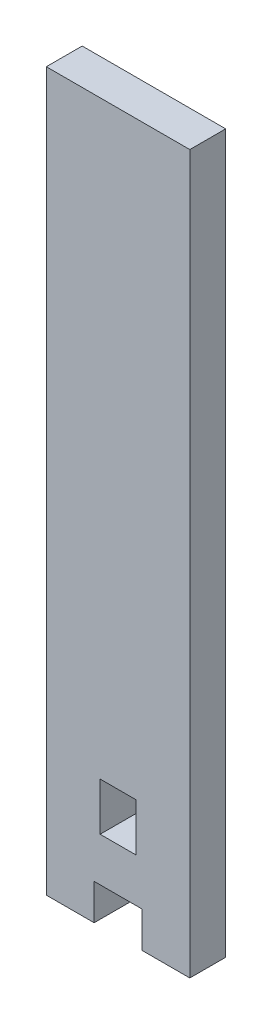
ISO-10303-21;
HEADER;
FILE_DESCRIPTION(('STEP AP214'),'2;1');
FILE_NAME('part.step','',(''),(''),'','','');
FILE_SCHEMA(('AUTOMOTIVE_DESIGN { 1 0 10303 214 1 1 1 1 }'));
ENDSEC;
DATA;
#1=APPLICATION_CONTEXT('core data for automotive mechanical design processes');
#2=APPLICATION_PROTOCOL_DEFINITION('international standard','automotive_design',2000,#1);
#3=PRODUCT_CONTEXT('',#1,'mechanical');
#4=PRODUCT('Part','Part','',(#3));
#5=PRODUCT_RELATED_PRODUCT_CATEGORY('part','',(#4));
#6=PRODUCT_DEFINITION_FORMATION('','',#4);
#7=PRODUCT_DEFINITION_CONTEXT('part definition',#1,'design');
#8=PRODUCT_DEFINITION('design','',#6,#7);
#9=PRODUCT_DEFINITION_SHAPE('','',#8);
#10=(LENGTH_UNIT() NAMED_UNIT(*) SI_UNIT(.MILLI.,.METRE.));
#11=(NAMED_UNIT(*) PLANE_ANGLE_UNIT() SI_UNIT($,.RADIAN.));
#12=(NAMED_UNIT(*) SI_UNIT($,.STERADIAN.) SOLID_ANGLE_UNIT());
#13=UNCERTAINTY_MEASURE_WITH_UNIT(LENGTH_MEASURE(1.E-05),#10,'distance_accuracy_value','');
#14=(GEOMETRIC_REPRESENTATION_CONTEXT(3) GLOBAL_UNCERTAINTY_ASSIGNED_CONTEXT((#13)) GLOBAL_UNIT_ASSIGNED_CONTEXT((#10,
#11,#12)) REPRESENTATION_CONTEXT('',''));
#15=CARTESIAN_POINT('',(0.,0.,0.));
#16=DIRECTION('',(0.,0.,1.));
#17=DIRECTION('',(1.,0.,0.));
#18=AXIS2_PLACEMENT_3D('',#15,#16,#17);
#19=CARTESIAN_POINT('',(9.99999999999998,50.,5.));
#20=DIRECTION('',(0.,0.,-1.));
#21=DIRECTION('',(-1.,0.,0.));
#22=AXIS2_PLACEMENT_3D('',#19,#20,#21);
#23=PLANE('',#22);
#24=DIRECTION('',(0.,1.,0.));
#25=VECTOR('',#24,1.);
#26=CARTESIAN_POINT('',(10.,-50.,5.));
#27=LINE('',#26,#25);
#28=CARTESIAN_POINT('',(10.,-50.,5.));
#29=VERTEX_POINT('',#28);
#30=CARTESIAN_POINT('',(9.99999999999998,50.,5.));
#31=VERTEX_POINT('',#30);
#32=EDGE_CURVE('E150',#29,#31,#27,.T.);
#33=ORIENTED_EDGE('',*,*,#32,.T.);
#34=DIRECTION('',(-1.,0.,0.));
#35=VECTOR('',#34,1.);
#36=CARTESIAN_POINT('',(-10.,50.,5.));
#37=LINE('',#36,#35);
#38=CARTESIAN_POINT('',(-10.,50.,5.));
#39=VERTEX_POINT('',#38);
#40=EDGE_CURVE('E153',#31,#39,#37,.T.);
#41=ORIENTED_EDGE('',*,*,#40,.T.);
#42=DIRECTION('',(0.,-1.,0.));
#43=VECTOR('',#42,1.);
#44=CARTESIAN_POINT('',(-10.,-50.,5.));
#45=LINE('',#44,#43);
#46=CARTESIAN_POINT('',(-10.,-50.,5.));
#47=VERTEX_POINT('',#46);
#48=EDGE_CURVE('E156',#39,#47,#45,.T.);
#49=ORIENTED_EDGE('',*,*,#48,.T.);
#50=DIRECTION('',(1.,0.,0.));
#51=VECTOR('',#50,1.);
#52=CARTESIAN_POINT('',(-10.,-50.,5.));
#53=LINE('',#52,#51);
#54=CARTESIAN_POINT('',(-3.33333333333333,-50.,5.));
#55=VERTEX_POINT('',#54);
#56=EDGE_CURVE('E158',#47,#55,#53,.T.);
#57=ORIENTED_EDGE('',*,*,#56,.T.);
#58=DIRECTION('',(0.,1.,0.));
#59=VECTOR('',#58,1.);
#60=CARTESIAN_POINT('',(-3.33333333333333,-50.,5.));
#61=LINE('',#60,#59);
#62=CARTESIAN_POINT('',(-3.33333333333333,-45.,5.));
#63=VERTEX_POINT('',#62);
#64=EDGE_CURVE('E160',#55,#63,#61,.T.);
#65=ORIENTED_EDGE('',*,*,#64,.T.);
#66=DIRECTION('',(1.,0.,0.));
#67=VECTOR('',#66,1.);
#68=CARTESIAN_POINT('',(-3.33333333333333,-45.,5.));
#69=LINE('',#68,#67);
#70=CARTESIAN_POINT('',(3.33333333333333,-45.,5.));
#71=VERTEX_POINT('',#70);
#72=EDGE_CURVE('E162',#63,#71,#69,.T.);
#73=ORIENTED_EDGE('',*,*,#72,.T.);
#74=DIRECTION('',(0.,-1.,0.));
#75=VECTOR('',#74,1.);
#76=CARTESIAN_POINT('',(3.33333333333333,-50.,5.));
#77=LINE('',#76,#75);
#78=CARTESIAN_POINT('',(3.33333333333333,-50.,5.));
#79=VERTEX_POINT('',#78);
#80=EDGE_CURVE('E164',#71,#79,#77,.T.);
#81=ORIENTED_EDGE('',*,*,#80,.T.);
#82=DIRECTION('',(1.,0.,0.));
#83=VECTOR('',#82,1.);
#84=CARTESIAN_POINT('',(3.33333333333333,-50.,5.));
#85=LINE('',#84,#83);
#86=EDGE_CURVE('E166',#79,#29,#85,.T.);
#87=ORIENTED_EDGE('',*,*,#86,.T.);
#88=EDGE_LOOP('',(#33,#41,#49,#57,#65,#73,#81,#87));
#89=FACE_BOUND('',#88,.T.);
#90=DIRECTION('',(0.,-1.,0.));
#91=VECTOR('',#90,1.);
#92=CARTESIAN_POINT('',(2.50000000000003,-32.2327044025157,5.00000000000002));
#93=LINE('',#92,#91);
#94=CARTESIAN_POINT('',(2.50000000000003,-32.2327044025157,5.00000000000002));
#95=VERTEX_POINT('',#94);
#96=CARTESIAN_POINT('',(2.50000000000002,-38.8993710691824,5.00000000000002));
#97=VERTEX_POINT('',#96);
#98=EDGE_CURVE('E135',#95,#97,#93,.T.);
#99=ORIENTED_EDGE('',*,*,#98,.T.);
#100=DIRECTION('',(-1.,0.,0.));
#101=VECTOR('',#100,1.);
#102=CARTESIAN_POINT('',(2.50000000000002,-38.8993710691824,5.00000000000002));
#103=LINE('',#102,#101);
#104=CARTESIAN_POINT('',(-2.49999999999998,-38.8993710691824,5.00000000000002));
#105=VERTEX_POINT('',#104);
#106=EDGE_CURVE('E140',#97,#105,#103,.T.);
#107=ORIENTED_EDGE('',*,*,#106,.T.);
#108=DIRECTION('',(0.,-1.,0.));
#109=VECTOR('',#108,1.);
#110=CARTESIAN_POINT('',(-2.49999999999997,-32.2327044025157,5.00000000000002));
#111=LINE('',#110,#109);
#112=CARTESIAN_POINT('',(-2.49999999999997,-32.2327044025157,5.));
#113=VERTEX_POINT('',#112);
#114=EDGE_CURVE('E209',#113,#105,#111,.T.);
#115=ORIENTED_EDGE('',*,*,#114,.F.);
#116=DIRECTION('',(-1.,0.,0.));
#117=VECTOR('',#116,1.);
#118=CARTESIAN_POINT('',(2.50000000000003,-32.2327044025157,5.00000000000002));
#119=LINE('',#118,#117);
#120=EDGE_CURVE('E46',#95,#113,#119,.T.);
#121=ORIENTED_EDGE('',*,*,#120,.F.);
#122=EDGE_LOOP('',(#99,#107,#115,#121));
#123=FACE_BOUND('',#122,.T.);
#124=ADVANCED_FACE('F31',(#89,#123),#23,.F.);
#125=CARTESIAN_POINT('',(9.99999999999998,50.,0.));
#126=DIRECTION('',(0.,0.,-1.));
#127=DIRECTION('',(-1.,0.,0.));
#128=AXIS2_PLACEMENT_3D('',#125,#126,#127);
#129=PLANE('',#128);
#130=DIRECTION('',(-1.,0.,0.));
#131=VECTOR('',#130,1.);
#132=CARTESIAN_POINT('',(2.50000000000002,-38.8993710691824,0.));
#133=LINE('',#132,#131);
#134=CARTESIAN_POINT('',(2.50000000000002,-38.8993710691824,0.));
#135=VERTEX_POINT('',#134);
#136=CARTESIAN_POINT('',(-2.49999999999998,-38.8993710691824,0.));
#137=VERTEX_POINT('',#136);
#138=EDGE_CURVE('E54',#135,#137,#133,.T.);
#139=ORIENTED_EDGE('',*,*,#138,.F.);
#140=DIRECTION('',(0.,1.,0.));
#141=VECTOR('',#140,1.);
#142=CARTESIAN_POINT('',(2.50000000000009,50.,0.));
#143=LINE('',#142,#141);
#144=CARTESIAN_POINT('',(2.50000000000003,-32.2327044025157,0.));
#145=VERTEX_POINT('',#144);
#146=EDGE_CURVE('E11',#135,#145,#143,.T.);
#147=ORIENTED_EDGE('',*,*,#146,.T.);
#148=DIRECTION('',(-1.,0.,0.));
#149=VECTOR('',#148,1.);
#150=CARTESIAN_POINT('',(2.50000000000003,-32.2327044025157,0.));
#151=LINE('',#150,#149);
#152=CARTESIAN_POINT('',(-2.49999999999997,-32.2327044025157,0.));
#153=VERTEX_POINT('',#152);
#154=EDGE_CURVE('E121',#145,#153,#151,.T.);
#155=ORIENTED_EDGE('',*,*,#154,.T.);
#156=DIRECTION('',(0.,1.,0.));
#157=VECTOR('',#156,1.);
#158=CARTESIAN_POINT('',(-2.49999999999991,50.,0.));
#159=LINE('',#158,#157);
#160=EDGE_CURVE('E39',#137,#153,#159,.T.);
#161=ORIENTED_EDGE('',*,*,#160,.F.);
#162=EDGE_LOOP('',(#139,#147,#155,#161));
#163=FACE_BOUND('',#162,.T.);
#164=DIRECTION('',(0.,-1.,0.));
#165=VECTOR('',#164,1.);
#166=CARTESIAN_POINT('',(3.33333333333333,-50.,0.));
#167=LINE('',#166,#165);
#168=CARTESIAN_POINT('',(3.33333333333333,-45.,0.));
#169=VERTEX_POINT('',#168);
#170=CARTESIAN_POINT('',(3.33333333333333,-50.,0.));
#171=VERTEX_POINT('',#170);
#172=EDGE_CURVE('E181',#169,#171,#167,.T.);
#173=ORIENTED_EDGE('',*,*,#172,.F.);
#174=DIRECTION('',(1.,0.,0.));
#175=VECTOR('',#174,1.);
#176=CARTESIAN_POINT('',(-3.33333333333333,-45.,0.));
#177=LINE('',#176,#175);
#178=CARTESIAN_POINT('',(-3.33333333333333,-45.,0.));
#179=VERTEX_POINT('',#178);
#180=EDGE_CURVE('E179',#179,#169,#177,.T.);
#181=ORIENTED_EDGE('',*,*,#180,.F.);
#182=DIRECTION('',(0.,1.,0.));
#183=VECTOR('',#182,1.);
#184=CARTESIAN_POINT('',(-3.33333333333333,-50.,0.));
#185=LINE('',#184,#183);
#186=CARTESIAN_POINT('',(-3.33333333333333,-50.,0.));
#187=VERTEX_POINT('',#186);
#188=EDGE_CURVE('E177',#187,#179,#185,.T.);
#189=ORIENTED_EDGE('',*,*,#188,.F.);
#190=DIRECTION('',(1.,0.,0.));
#191=VECTOR('',#190,1.);
#192=CARTESIAN_POINT('',(-10.,-50.,0.));
#193=LINE('',#192,#191);
#194=CARTESIAN_POINT('',(-10.,-50.,0.));
#195=VERTEX_POINT('',#194);
#196=EDGE_CURVE('E175',#195,#187,#193,.T.);
#197=ORIENTED_EDGE('',*,*,#196,.F.);
#198=DIRECTION('',(0.,-1.,0.));
#199=VECTOR('',#198,1.);
#200=CARTESIAN_POINT('',(-10.,-50.,0.));
#201=LINE('',#200,#199);
#202=CARTESIAN_POINT('',(-10.,50.,0.));
#203=VERTEX_POINT('',#202);
#204=EDGE_CURVE('E173',#203,#195,#201,.T.);
#205=ORIENTED_EDGE('',*,*,#204,.F.);
#206=DIRECTION('',(-1.,0.,0.));
#207=VECTOR('',#206,1.);
#208=CARTESIAN_POINT('',(-10.,50.,0.));
#209=LINE('',#208,#207);
#210=CARTESIAN_POINT('',(9.99999999999998,50.,0.));
#211=VERTEX_POINT('',#210);
#212=EDGE_CURVE('E171',#211,#203,#209,.T.);
#213=ORIENTED_EDGE('',*,*,#212,.F.);
#214=DIRECTION('',(0.,1.,0.));
#215=VECTOR('',#214,1.);
#216=CARTESIAN_POINT('',(10.,-50.,0.));
#217=LINE('',#216,#215);
#218=CARTESIAN_POINT('',(10.,-50.,0.));
#219=VERTEX_POINT('',#218);
#220=EDGE_CURVE('E129',#219,#211,#217,.T.);
#221=ORIENTED_EDGE('',*,*,#220,.F.);
#222=DIRECTION('',(1.,0.,0.));
#223=VECTOR('',#222,1.);
#224=CARTESIAN_POINT('',(3.33333333333333,-50.,0.));
#225=LINE('',#224,#223);
#226=EDGE_CURVE('E154',#171,#219,#225,.T.);
#227=ORIENTED_EDGE('',*,*,#226,.F.);
#228=EDGE_LOOP('',(#173,#181,#189,#197,#205,#213,#221,#227));
#229=FACE_BOUND('',#228,.T.);
#230=ADVANCED_FACE('F138',(#163,#229),#129,.T.);
#231=CARTESIAN_POINT('',(10.,-50.,5.));
#232=DIRECTION('',(-1.,0.,0.));
#233=DIRECTION('',(0.,-1.,0.));
#234=AXIS2_PLACEMENT_3D('',#231,#232,#233);
#235=PLANE('',#234);
#236=ORIENTED_EDGE('',*,*,#220,.T.);
#237=DIRECTION('',(0.,0.,-1.));
#238=VECTOR('',#237,1.);
#239=CARTESIAN_POINT('',(9.99999999999998,50.,5.));
#240=LINE('',#239,#238);
#241=EDGE_CURVE('E204',#31,#211,#240,.T.);
#242=ORIENTED_EDGE('',*,*,#241,.F.);
#243=ORIENTED_EDGE('',*,*,#32,.F.);
#244=DIRECTION('',(0.,0.,-1.));
#245=VECTOR('',#244,1.);
#246=CARTESIAN_POINT('',(10.,-50.,5.));
#247=LINE('',#246,#245);
#248=EDGE_CURVE('E168',#29,#219,#247,.T.);
#249=ORIENTED_EDGE('',*,*,#248,.T.);
#250=EDGE_LOOP('',(#236,#242,#243,#249));
#251=FACE_BOUND('',#250,.T.);
#252=ADVANCED_FACE('F33',(#251),#235,.F.);
#253=CARTESIAN_POINT('',(-10.,50.,5.));
#254=DIRECTION('',(0.,-1.,0.));
#255=DIRECTION('',(1.,0.,0.));
#256=AXIS2_PLACEMENT_3D('',#253,#254,#255);
#257=PLANE('',#256);
#258=ORIENTED_EDGE('',*,*,#212,.T.);
#259=DIRECTION('',(0.,0.,-1.));
#260=VECTOR('',#259,1.);
#261=CARTESIAN_POINT('',(-10.,50.,5.));
#262=LINE('',#261,#260);
#263=EDGE_CURVE('E201',#39,#203,#262,.T.);
#264=ORIENTED_EDGE('',*,*,#263,.F.);
#265=ORIENTED_EDGE('',*,*,#40,.F.);
#266=ORIENTED_EDGE('',*,*,#241,.T.);
#267=EDGE_LOOP('',(#258,#264,#265,#266));
#268=FACE_BOUND('',#267,.T.);
#269=ADVANCED_FACE('F254',(#268),#257,.F.);
#270=CARTESIAN_POINT('',(-10.,-50.,5.));
#271=DIRECTION('',(1.,0.,0.));
#272=DIRECTION('',(0.,0.,-1.));
#273=AXIS2_PLACEMENT_3D('',#270,#271,#272);
#274=PLANE('',#273);
#275=ORIENTED_EDGE('',*,*,#204,.T.);
#276=DIRECTION('',(0.,0.,-1.));
#277=VECTOR('',#276,1.);
#278=CARTESIAN_POINT('',(-10.,-50.,5.));
#279=LINE('',#278,#277);
#280=EDGE_CURVE('E198',#47,#195,#279,.T.);
#281=ORIENTED_EDGE('',*,*,#280,.F.);
#282=ORIENTED_EDGE('',*,*,#48,.F.);
#283=ORIENTED_EDGE('',*,*,#263,.T.);
#284=EDGE_LOOP('',(#275,#281,#282,#283));
#285=FACE_BOUND('',#284,.T.);
#286=ADVANCED_FACE('F251',(#285),#274,.F.);
#287=CARTESIAN_POINT('',(-10.,-50.,5.));
#288=DIRECTION('',(0.,1.,0.));
#289=DIRECTION('',(0.,0.,1.));
#290=AXIS2_PLACEMENT_3D('',#287,#288,#289);
#291=PLANE('',#290);
#292=ORIENTED_EDGE('',*,*,#196,.T.);
#293=DIRECTION('',(0.,0.,-1.));
#294=VECTOR('',#293,1.);
#295=CARTESIAN_POINT('',(-3.33333333333333,-50.,5.));
#296=LINE('',#295,#294);
#297=EDGE_CURVE('E195',#55,#187,#296,.T.);
#298=ORIENTED_EDGE('',*,*,#297,.F.);
#299=ORIENTED_EDGE('',*,*,#56,.F.);
#300=ORIENTED_EDGE('',*,*,#280,.T.);
#301=EDGE_LOOP('',(#292,#298,#299,#300));
#302=FACE_BOUND('',#301,.T.);
#303=ADVANCED_FACE('F247',(#302),#291,.F.);
#304=CARTESIAN_POINT('',(-3.33333333333333,-50.,5.));
#305=DIRECTION('',(-1.,0.,0.));
#306=DIRECTION('',(0.,-1.,0.));
#307=AXIS2_PLACEMENT_3D('',#304,#305,#306);
#308=PLANE('',#307);
#309=ORIENTED_EDGE('',*,*,#188,.T.);
#310=DIRECTION('',(0.,0.,-1.));
#311=VECTOR('',#310,1.);
#312=CARTESIAN_POINT('',(-3.33333333333333,-45.,5.));
#313=LINE('',#312,#311);
#314=EDGE_CURVE('E192',#63,#179,#313,.T.);
#315=ORIENTED_EDGE('',*,*,#314,.F.);
#316=ORIENTED_EDGE('',*,*,#64,.F.);
#317=ORIENTED_EDGE('',*,*,#297,.T.);
#318=EDGE_LOOP('',(#309,#315,#316,#317));
#319=FACE_BOUND('',#318,.T.);
#320=ADVANCED_FACE('F243',(#319),#308,.F.);
#321=CARTESIAN_POINT('',(-3.33333333333333,-45.,5.));
#322=DIRECTION('',(0.,1.,0.));
#323=DIRECTION('',(0.,0.,1.));
#324=AXIS2_PLACEMENT_3D('',#321,#322,#323);
#325=PLANE('',#324);
#326=ORIENTED_EDGE('',*,*,#180,.T.);
#327=DIRECTION('',(0.,0.,-1.));
#328=VECTOR('',#327,1.);
#329=CARTESIAN_POINT('',(3.33333333333333,-45.,5.));
#330=LINE('',#329,#328);
#331=EDGE_CURVE('E189',#71,#169,#330,.T.);
#332=ORIENTED_EDGE('',*,*,#331,.F.);
#333=ORIENTED_EDGE('',*,*,#72,.F.);
#334=ORIENTED_EDGE('',*,*,#314,.T.);
#335=EDGE_LOOP('',(#326,#332,#333,#334));
#336=FACE_BOUND('',#335,.T.);
#337=ADVANCED_FACE('F239',(#336),#325,.F.);
#338=CARTESIAN_POINT('',(3.33333333333333,-50.,5.));
#339=DIRECTION('',(1.,0.,0.));
#340=DIRECTION('',(0.,1.,0.));
#341=AXIS2_PLACEMENT_3D('',#338,#339,#340);
#342=PLANE('',#341);
#343=ORIENTED_EDGE('',*,*,#172,.T.);
#344=DIRECTION('',(0.,0.,-1.));
#345=VECTOR('',#344,1.);
#346=CARTESIAN_POINT('',(3.33333333333333,-50.,5.));
#347=LINE('',#346,#345);
#348=EDGE_CURVE('E186',#79,#171,#347,.T.);
#349=ORIENTED_EDGE('',*,*,#348,.F.);
#350=ORIENTED_EDGE('',*,*,#80,.F.);
#351=ORIENTED_EDGE('',*,*,#331,.T.);
#352=EDGE_LOOP('',(#343,#349,#350,#351));
#353=FACE_BOUND('',#352,.T.);
#354=ADVANCED_FACE('F235',(#353),#342,.F.);
#355=CARTESIAN_POINT('',(3.33333333333333,-50.,5.));
#356=DIRECTION('',(0.,1.,0.));
#357=DIRECTION('',(0.,0.,1.));
#358=AXIS2_PLACEMENT_3D('',#355,#356,#357);
#359=PLANE('',#358);
#360=ORIENTED_EDGE('',*,*,#226,.T.);
#361=ORIENTED_EDGE('',*,*,#248,.F.);
#362=ORIENTED_EDGE('',*,*,#86,.F.);
#363=ORIENTED_EDGE('',*,*,#348,.T.);
#364=EDGE_LOOP('',(#360,#361,#362,#363));
#365=FACE_BOUND('',#364,.T.);
#366=ADVANCED_FACE('F221',(#365),#359,.F.);
#367=CARTESIAN_POINT('',(2.50000000000003,-32.2327044025157,0.));
#368=DIRECTION('',(0.,-1.,0.));
#369=DIRECTION('',(1.,0.,0.));
#370=AXIS2_PLACEMENT_3D('',#367,#368,#369);
#371=PLANE('',#370);
#372=DIRECTION('',(0.,0.,1.));
#373=VECTOR('',#372,1.);
#374=CARTESIAN_POINT('',(-2.49999999999997,-32.2327044025157,0.));
#375=LINE('',#374,#373);
#376=EDGE_CURVE('E126',#153,#113,#375,.T.);
#377=ORIENTED_EDGE('',*,*,#376,.F.);
#378=ORIENTED_EDGE('',*,*,#154,.F.);
#379=DIRECTION('',(0.,0.,1.));
#380=VECTOR('',#379,1.);
#381=CARTESIAN_POINT('',(2.50000000000003,-32.2327044025157,0.));
#382=LINE('',#381,#380);
#383=EDGE_CURVE('E124',#145,#95,#382,.T.);
#384=ORIENTED_EDGE('',*,*,#383,.T.);
#385=ORIENTED_EDGE('',*,*,#120,.T.);
#386=EDGE_LOOP('',(#377,#378,#384,#385));
#387=FACE_BOUND('',#386,.T.);
#388=ADVANCED_FACE('F123',(#387),#371,.T.);
#389=CARTESIAN_POINT('',(2.50000000000002,-38.8993710691824,0.));
#390=DIRECTION('',(0.,1.,0.));
#391=DIRECTION('',(0.,0.,1.));
#392=AXIS2_PLACEMENT_3D('',#389,#390,#391);
#393=PLANE('',#392);
#394=DIRECTION('',(0.,0.,-1.));
#395=VECTOR('',#394,1.);
#396=CARTESIAN_POINT('',(-2.49999999999998,-38.8993710691824,0.));
#397=LINE('',#396,#395);
#398=EDGE_CURVE('E136',#105,#137,#397,.T.);
#399=ORIENTED_EDGE('',*,*,#398,.F.);
#400=ORIENTED_EDGE('',*,*,#106,.F.);
#401=DIRECTION('',(0.,0.,-1.));
#402=VECTOR('',#401,1.);
#403=CARTESIAN_POINT('',(2.50000000000002,-38.8993710691824,0.));
#404=LINE('',#403,#402);
#405=EDGE_CURVE('E141',#97,#135,#404,.T.);
#406=ORIENTED_EDGE('',*,*,#405,.T.);
#407=ORIENTED_EDGE('',*,*,#138,.T.);
#408=EDGE_LOOP('',(#399,#400,#406,#407));
#409=FACE_BOUND('',#408,.T.);
#410=ADVANCED_FACE('F213',(#409),#393,.T.);
#411=CARTESIAN_POINT('',(2.50000000000002,-45.,0.));
#412=DIRECTION('',(-1.,0.,0.));
#413=DIRECTION('',(0.,0.,-1.));
#414=AXIS2_PLACEMENT_3D('',#411,#412,#413);
#415=PLANE('',#414);
#416=ORIENTED_EDGE('',*,*,#405,.F.);
#417=ORIENTED_EDGE('',*,*,#98,.F.);
#418=ORIENTED_EDGE('',*,*,#383,.F.);
#419=ORIENTED_EDGE('',*,*,#146,.F.);
#420=EDGE_LOOP('',(#416,#417,#418,#419));
#421=FACE_BOUND('',#420,.T.);
#422=ADVANCED_FACE('F133',(#421),#415,.T.);
#423=CARTESIAN_POINT('',(-2.49999999999998,-45.,0.));
#424=DIRECTION('',(-1.,0.,0.));
#425=DIRECTION('',(0.,0.,-1.));
#426=AXIS2_PLACEMENT_3D('',#423,#424,#425);
#427=PLANE('',#426);
#428=ORIENTED_EDGE('',*,*,#160,.T.);
#429=ORIENTED_EDGE('',*,*,#376,.T.);
#430=ORIENTED_EDGE('',*,*,#114,.T.);
#431=ORIENTED_EDGE('',*,*,#398,.T.);
#432=EDGE_LOOP('',(#428,#429,#430,#431));
#433=FACE_BOUND('',#432,.T.);
#434=ADVANCED_FACE('F207',(#433),#427,.F.);
#435=CLOSED_SHELL('',(#124,#230,#252,#269,#286,#303,#320,#337,#354,#366,#388,#410,#422,#434));
#436=MANIFOLD_SOLID_BREP('B2',#435);
#437=ADVANCED_BREP_SHAPE_REPRESENTATION('',(#18,#436),#14);
#438=SHAPE_DEFINITION_REPRESENTATION(#9,#437);
ENDSEC;
END-ISO-10303-21;
